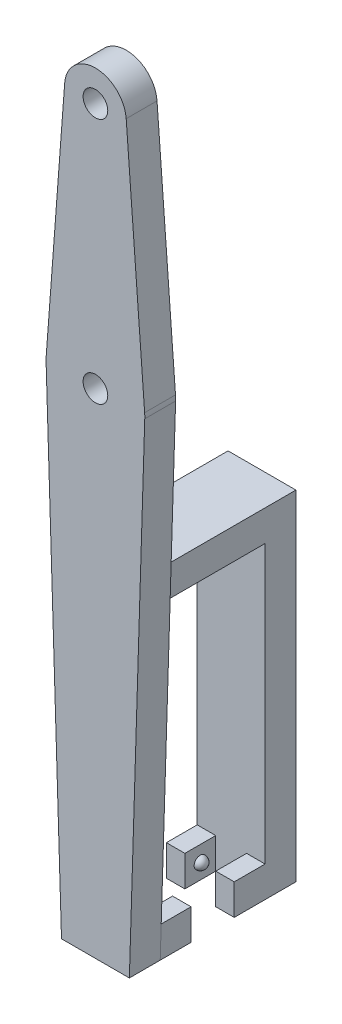
ISO-10303-21;
HEADER;
FILE_DESCRIPTION(('STEP AP214'),'2;1');
FILE_NAME('part.step','',(''),(''),'','','');
FILE_SCHEMA(('AUTOMOTIVE_DESIGN { 1 0 10303 214 1 1 1 1 }'));
ENDSEC;
DATA;
#1=APPLICATION_CONTEXT('core data for automotive mechanical design processes');
#2=APPLICATION_PROTOCOL_DEFINITION('international standard','automotive_design',2000,#1);
#3=PRODUCT_CONTEXT('',#1,'mechanical');
#4=PRODUCT('Part','Part','',(#3));
#5=PRODUCT_RELATED_PRODUCT_CATEGORY('part','',(#4));
#6=PRODUCT_DEFINITION_FORMATION('','',#4);
#7=PRODUCT_DEFINITION_CONTEXT('part definition',#1,'design');
#8=PRODUCT_DEFINITION('design','',#6,#7);
#9=PRODUCT_DEFINITION_SHAPE('','',#8);
#10=(LENGTH_UNIT() NAMED_UNIT(*) SI_UNIT(.MILLI.,.METRE.));
#11=(NAMED_UNIT(*) PLANE_ANGLE_UNIT() SI_UNIT($,.RADIAN.));
#12=(NAMED_UNIT(*) SI_UNIT($,.STERADIAN.) SOLID_ANGLE_UNIT());
#13=UNCERTAINTY_MEASURE_WITH_UNIT(LENGTH_MEASURE(1.E-05),#10,'distance_accuracy_value','');
#14=(GEOMETRIC_REPRESENTATION_CONTEXT(3) GLOBAL_UNCERTAINTY_ASSIGNED_CONTEXT((#13)) GLOBAL_UNIT_ASSIGNED_CONTEXT((#10,
#11,#12)) REPRESENTATION_CONTEXT('',''));
#15=CARTESIAN_POINT('',(0.,0.,0.));
#16=DIRECTION('',(0.,0.,1.));
#17=DIRECTION('',(1.,0.,0.));
#18=AXIS2_PLACEMENT_3D('',#15,#16,#17);
#19=CARTESIAN_POINT('',(0.,-62.4999999999999,5.));
#20=DIRECTION('',(0.,1.,0.));
#21=DIRECTION('',(0.,0.,1.));
#22=AXIS2_PLACEMENT_3D('',#19,#20,#21);
#23=PLANE('',#22);
#24=DIRECTION('',(0.,0.,1.));
#25=VECTOR('',#24,1.);
#26=CARTESIAN_POINT('',(2.50000000000002,-62.4999999999999,5.));
#27=LINE('',#26,#25);
#28=CARTESIAN_POINT('',(2.50000000000002,-62.4999999999999,-17.));
#29=VERTEX_POINT('',#28);
#30=CARTESIAN_POINT('',(2.50000000000002,-62.4999999999999,-12.));
#31=VERTEX_POINT('',#30);
#32=EDGE_CURVE('E891',#29,#31,#27,.T.);
#33=ORIENTED_EDGE('',*,*,#32,.F.);
#34=DIRECTION('',(1.,0.,0.));
#35=VECTOR('',#34,1.);
#36=CARTESIAN_POINT('',(0.,-62.4999999999999,-17.));
#37=LINE('',#36,#35);
#38=CARTESIAN_POINT('',(-2.49999999999998,-62.4999999999999,-17.));
#39=VERTEX_POINT('',#38);
#40=EDGE_CURVE('E219',#39,#29,#37,.T.);
#41=ORIENTED_EDGE('',*,*,#40,.F.);
#42=DIRECTION('',(0.,0.,-1.));
#43=VECTOR('',#42,1.);
#44=CARTESIAN_POINT('',(-2.49999999999999,-62.4999999999999,5.));
#45=LINE('',#44,#43);
#46=CARTESIAN_POINT('',(-2.49999999999998,-62.4999999999999,-12.));
#47=VERTEX_POINT('',#46);
#48=EDGE_CURVE('E889',#47,#39,#45,.T.);
#49=ORIENTED_EDGE('',*,*,#48,.F.);
#50=DIRECTION('',(-1.,0.,0.));
#51=VECTOR('',#50,1.);
#52=CARTESIAN_POINT('',(0.,-62.4999999999999,-12.));
#53=LINE('',#52,#51);
#54=CARTESIAN_POINT('',(-5.49999999999998,-62.4999999999999,-12.));
#55=VERTEX_POINT('',#54);
#56=EDGE_CURVE('E236',#47,#55,#53,.T.);
#57=ORIENTED_EDGE('',*,*,#56,.T.);
#58=DIRECTION('',(0.,0.,1.));
#59=VECTOR('',#58,1.);
#60=CARTESIAN_POINT('',(-5.5,-62.4999999999999,-22.));
#61=LINE('',#60,#59);
#62=CARTESIAN_POINT('',(-5.5,-62.4999999999999,-22.));
#63=VERTEX_POINT('',#62);
#64=EDGE_CURVE('E250',#63,#55,#61,.T.);
#65=ORIENTED_EDGE('',*,*,#64,.F.);
#66=DIRECTION('',(-1.,0.,0.));
#67=VECTOR('',#66,1.);
#68=CARTESIAN_POINT('',(5.5,-62.4999999999999,-22.));
#69=LINE('',#68,#67);
#70=CARTESIAN_POINT('',(5.5,-62.4999999999999,-22.));
#71=VERTEX_POINT('',#70);
#72=EDGE_CURVE('E254',#71,#63,#69,.T.);
#73=ORIENTED_EDGE('',*,*,#72,.F.);
#74=DIRECTION('',(0.,0.,-1.));
#75=VECTOR('',#74,1.);
#76=CARTESIAN_POINT('',(5.5,-62.4999999999999,-22.));
#77=LINE('',#76,#75);
#78=CARTESIAN_POINT('',(5.50000000000002,-62.4999999999999,-12.));
#79=VERTEX_POINT('',#78);
#80=EDGE_CURVE('E253',#79,#71,#77,.T.);
#81=ORIENTED_EDGE('',*,*,#80,.F.);
#82=EDGE_CURVE('E239',#79,#31,#53,.T.);
#83=ORIENTED_EDGE('',*,*,#82,.T.);
#84=EDGE_LOOP('',(#33,#41,#49,#57,#65,#73,#81,#83));
#85=FACE_BOUND('',#84,.T.);
#86=ADVANCED_FACE('F35',(#85),#23,.F.);
#87=CARTESIAN_POINT('',(0.,-57.5,-12.));
#88=DIRECTION('',(0.,-1.,0.));
#89=DIRECTION('',(0.,0.,-1.));
#90=AXIS2_PLACEMENT_3D('',#87,#88,#89);
#91=PLANE('',#90);
#92=DIRECTION('',(0.,0.,1.));
#93=VECTOR('',#92,1.);
#94=CARTESIAN_POINT('',(2.50000000000002,-57.5,-17.));
#95=LINE('',#94,#93);
#96=CARTESIAN_POINT('',(2.50000000000002,-57.5,-17.));
#97=VERTEX_POINT('',#96);
#98=CARTESIAN_POINT('',(2.50000000000002,-57.5,-12.));
#99=VERTEX_POINT('',#98);
#100=EDGE_CURVE('E225',#97,#99,#95,.T.);
#101=ORIENTED_EDGE('',*,*,#100,.T.);
#102=DIRECTION('',(-1.,0.,0.));
#103=VECTOR('',#102,1.);
#104=CARTESIAN_POINT('',(0.,-57.5,-12.));
#105=LINE('',#104,#103);
#106=CARTESIAN_POINT('',(5.50000000000002,-57.5,-12.));
#107=VERTEX_POINT('',#106);
#108=EDGE_CURVE('E902',#107,#99,#105,.T.);
#109=ORIENTED_EDGE('',*,*,#108,.F.);
#110=DIRECTION('',(0.,0.,-1.));
#111=VECTOR('',#110,1.);
#112=CARTESIAN_POINT('',(5.50000000000002,-57.5,-12.));
#113=LINE('',#112,#111);
#114=CARTESIAN_POINT('',(5.5,-57.5,-17.));
#115=VERTEX_POINT('',#114);
#116=EDGE_CURVE('E235',#107,#115,#113,.T.);
#117=ORIENTED_EDGE('',*,*,#116,.T.);
#118=DIRECTION('',(-1.,0.,0.));
#119=VECTOR('',#118,1.);
#120=CARTESIAN_POINT('',(0.,-57.5,-17.));
#121=LINE('',#120,#119);
#122=EDGE_CURVE('E60',#115,#97,#121,.T.);
#123=ORIENTED_EDGE('',*,*,#122,.T.);
#124=EDGE_LOOP('',(#101,#109,#117,#123));
#125=FACE_BOUND('',#124,.T.);
#126=ADVANCED_FACE('F233',(#125),#91,.F.);
#127=DIRECTION('',(0.,0.,-1.));
#128=VECTOR('',#127,1.);
#129=CARTESIAN_POINT('',(-2.49999999999998,-57.5,-17.));
#130=LINE('',#129,#128);
#131=CARTESIAN_POINT('',(-2.49999999999998,-57.5,-12.));
#132=VERTEX_POINT('',#131);
#133=CARTESIAN_POINT('',(-2.49999999999998,-57.5,-17.));
#134=VERTEX_POINT('',#133);
#135=EDGE_CURVE('E52',#132,#134,#130,.T.);
#136=ORIENTED_EDGE('',*,*,#135,.T.);
#137=CARTESIAN_POINT('',(-5.5,-57.5,-17.));
#138=VERTEX_POINT('',#137);
#139=EDGE_CURVE('E237',#134,#138,#121,.T.);
#140=ORIENTED_EDGE('',*,*,#139,.T.);
#141=DIRECTION('',(0.,0.,-1.));
#142=VECTOR('',#141,1.);
#143=CARTESIAN_POINT('',(-5.49999999999998,-57.5,-12.));
#144=LINE('',#143,#142);
#145=CARTESIAN_POINT('',(-5.49999999999998,-57.5,-12.));
#146=VERTEX_POINT('',#145);
#147=EDGE_CURVE('E245',#146,#138,#144,.T.);
#148=ORIENTED_EDGE('',*,*,#147,.F.);
#149=EDGE_CURVE('E901',#132,#146,#105,.T.);
#150=ORIENTED_EDGE('',*,*,#149,.F.);
#151=EDGE_LOOP('',(#136,#140,#148,#150));
#152=FACE_BOUND('',#151,.T.);
#153=ADVANCED_FACE('F447',(#152),#91,.F.);
#154=CARTESIAN_POINT('',(0.,0.,-12.));
#155=DIRECTION('',(0.,0.,1.));
#156=DIRECTION('',(-1.,0.,0.));
#157=AXIS2_PLACEMENT_3D('',#154,#155,#156);
#158=PLANE('',#157);
#159=ORIENTED_EDGE('',*,*,#108,.T.);
#160=DIRECTION('',(0.,-1.,0.));
#161=VECTOR('',#160,1.);
#162=CARTESIAN_POINT('',(2.50000000000002,0.,-12.));
#163=LINE('',#162,#161);
#164=EDGE_CURVE('E11',#99,#31,#163,.T.);
#165=ORIENTED_EDGE('',*,*,#164,.T.);
#166=ORIENTED_EDGE('',*,*,#82,.F.);
#167=DIRECTION('',(0.,1.,0.));
#168=VECTOR('',#167,1.);
#169=CARTESIAN_POINT('',(5.50000000000002,0.,-12.));
#170=LINE('',#169,#168);
#171=EDGE_CURVE('E900',#79,#107,#170,.T.);
#172=ORIENTED_EDGE('',*,*,#171,.T.);
#173=EDGE_LOOP('',(#159,#165,#166,#172));
#174=FACE_BOUND('',#173,.T.);
#175=ADVANCED_FACE('F620',(#174),#158,.T.);
#176=ORIENTED_EDGE('',*,*,#56,.F.);
#177=DIRECTION('',(0.,1.,0.));
#178=VECTOR('',#177,1.);
#179=CARTESIAN_POINT('',(-2.49999999999998,0.,-12.));
#180=LINE('',#179,#178);
#181=EDGE_CURVE('E44',#47,#132,#180,.T.);
#182=ORIENTED_EDGE('',*,*,#181,.T.);
#183=ORIENTED_EDGE('',*,*,#149,.T.);
#184=DIRECTION('',(0.,1.,0.));
#185=VECTOR('',#184,1.);
#186=CARTESIAN_POINT('',(-5.49999999999998,0.,-12.));
#187=LINE('',#186,#185);
#188=EDGE_CURVE('E243',#55,#146,#187,.T.);
#189=ORIENTED_EDGE('',*,*,#188,.F.);
#190=EDGE_LOOP('',(#176,#182,#183,#189));
#191=FACE_BOUND('',#190,.T.);
#192=ADVANCED_FACE('F454',(#191),#158,.T.);
#193=CARTESIAN_POINT('',(5.5,-74.5830459735945,-17.));
#194=DIRECTION('',(0.,0.,-1.));
#195=DIRECTION('',(-1.,0.,0.));
#196=AXIS2_PLACEMENT_3D('',#193,#194,#195);
#197=PLANE('',#196);
#198=ORIENTED_EDGE('',*,*,#122,.F.);
#199=DIRECTION('',(0.,1.,0.));
#200=VECTOR('',#199,1.);
#201=CARTESIAN_POINT('',(5.5,-74.5830459735945,-17.));
#202=LINE('',#201,#200);
#203=CARTESIAN_POINT('',(5.5,-12.4999999999999,-17.));
#204=VERTEX_POINT('',#203);
#205=EDGE_CURVE('E262',#115,#204,#202,.T.);
#206=ORIENTED_EDGE('',*,*,#205,.T.);
#207=DIRECTION('',(-1.,0.,0.));
#208=VECTOR('',#207,1.);
#209=CARTESIAN_POINT('',(5.5,-12.4999999999999,-17.));
#210=LINE('',#209,#208);
#211=CARTESIAN_POINT('',(-5.5,-12.4999999999999,-17.));
#212=VERTEX_POINT('',#211);
#213=EDGE_CURVE('E249',#204,#212,#210,.T.);
#214=ORIENTED_EDGE('',*,*,#213,.T.);
#215=DIRECTION('',(0.,1.,0.));
#216=VECTOR('',#215,1.);
#217=CARTESIAN_POINT('',(-5.5,-74.5830459735945,-17.));
#218=LINE('',#217,#216);
#219=EDGE_CURVE('E260',#138,#212,#218,.T.);
#220=ORIENTED_EDGE('',*,*,#219,.F.);
#221=ORIENTED_EDGE('',*,*,#139,.F.);
#222=DIRECTION('',(0.,1.,0.));
#223=VECTOR('',#222,1.);
#224=CARTESIAN_POINT('',(-2.49999999999998,-77.4999999999999,-17.));
#225=LINE('',#224,#223);
#226=EDGE_CURVE('E222',#39,#134,#225,.T.);
#227=ORIENTED_EDGE('',*,*,#226,.F.);
#228=ORIENTED_EDGE('',*,*,#40,.T.);
#229=DIRECTION('',(0.,1.,0.));
#230=VECTOR('',#229,1.);
#231=CARTESIAN_POINT('',(2.50000000000002,-77.4999999999999,-17.));
#232=LINE('',#231,#230);
#233=EDGE_CURVE('E214',#29,#97,#232,.T.);
#234=ORIENTED_EDGE('',*,*,#233,.T.);
#235=EDGE_LOOP('',(#198,#206,#214,#220,#221,#227,#228,#234));
#236=FACE_BOUND('',#235,.T.);
#237=ADVANCED_FACE('F216',(#236),#197,.F.);
#238=CARTESIAN_POINT('',(0.,-12.4999999999999,-22.));
#239=DIRECTION('',(0.,1.,0.));
#240=DIRECTION('',(0.,0.,1.));
#241=AXIS2_PLACEMENT_3D('',#238,#239,#240);
#242=PLANE('',#241);
#243=ORIENTED_EDGE('',*,*,#213,.F.);
#244=DIRECTION('',(0.,0.,1.));
#245=VECTOR('',#244,1.);
#246=CARTESIAN_POINT('',(5.5,-12.4999999999999,-22.));
#247=LINE('',#246,#245);
#248=CARTESIAN_POINT('',(5.5,-12.4999999999999,0.));
#249=VERTEX_POINT('',#248);
#250=EDGE_CURVE('E293',#204,#249,#247,.T.);
#251=ORIENTED_EDGE('',*,*,#250,.T.);
#252=DIRECTION('',(-1.,0.,0.));
#253=VECTOR('',#252,1.);
#254=CARTESIAN_POINT('',(0.,-12.4999999999999,0.));
#255=LINE('',#254,#253);
#256=CARTESIAN_POINT('',(-5.5,-12.4999999999999,0.));
#257=VERTEX_POINT('',#256);
#258=EDGE_CURVE('E283',#249,#257,#255,.T.);
#259=ORIENTED_EDGE('',*,*,#258,.T.);
#260=DIRECTION('',(0.,0.,1.));
#261=VECTOR('',#260,1.);
#262=CARTESIAN_POINT('',(-5.5,-12.4999999999999,-22.));
#263=LINE('',#262,#261);
#264=EDGE_CURVE('E310',#212,#257,#263,.T.);
#265=ORIENTED_EDGE('',*,*,#264,.F.);
#266=EDGE_LOOP('',(#243,#251,#259,#265));
#267=FACE_BOUND('',#266,.T.);
#268=ADVANCED_FACE('F453',(#267),#242,.F.);
#269=CARTESIAN_POINT('',(0.,-57.5,-5.));
#270=DIRECTION('',(0.,1.,0.));
#271=DIRECTION('',(0.,0.,1.));
#272=AXIS2_PLACEMENT_3D('',#269,#270,#271);
#273=PLANE('',#272);
#274=DIRECTION('',(0.,0.,-1.));
#275=VECTOR('',#274,1.);
#276=CARTESIAN_POINT('',(2.50000000000002,-57.5,0.));
#277=LINE('',#276,#275);
#278=CARTESIAN_POINT('',(2.50000000000002,-57.5,0.));
#279=VERTEX_POINT('',#278);
#280=CARTESIAN_POINT('',(2.50000000000002,-57.5,-5.));
#281=VERTEX_POINT('',#280);
#282=EDGE_CURVE('E257',#279,#281,#277,.T.);
#283=ORIENTED_EDGE('',*,*,#282,.F.);
#284=DIRECTION('',(-1.,0.,0.));
#285=VECTOR('',#284,1.);
#286=CARTESIAN_POINT('',(0.,-57.5,0.));
#287=LINE('',#286,#285);
#288=CARTESIAN_POINT('',(5.50000000000002,-57.5,0.));
#289=VERTEX_POINT('',#288);
#290=EDGE_CURVE('E331',#289,#279,#287,.T.);
#291=ORIENTED_EDGE('',*,*,#290,.F.);
#292=DIRECTION('',(0.,0.,1.));
#293=VECTOR('',#292,1.);
#294=CARTESIAN_POINT('',(5.50000000000002,-57.5,-5.));
#295=LINE('',#294,#293);
#296=CARTESIAN_POINT('',(5.50000000000002,-57.5,-5.));
#297=VERTEX_POINT('',#296);
#298=EDGE_CURVE('E338',#297,#289,#295,.T.);
#299=ORIENTED_EDGE('',*,*,#298,.F.);
#300=DIRECTION('',(-1.,0.,0.));
#301=VECTOR('',#300,1.);
#302=CARTESIAN_POINT('',(0.,-57.5,-5.));
#303=LINE('',#302,#301);
#304=EDGE_CURVE('E321',#297,#281,#303,.T.);
#305=ORIENTED_EDGE('',*,*,#304,.T.);
#306=EDGE_LOOP('',(#283,#291,#299,#305));
#307=FACE_BOUND('',#306,.T.);
#308=ADVANCED_FACE('F490',(#307),#273,.T.);
#309=CARTESIAN_POINT('',(0.,0.,-5.));
#310=DIRECTION('',(0.,0.,-1.));
#311=DIRECTION('',(-1.,0.,0.));
#312=AXIS2_PLACEMENT_3D('',#309,#310,#311);
#313=PLANE('',#312);
#314=DIRECTION('',(0.,-1.,0.));
#315=VECTOR('',#314,1.);
#316=CARTESIAN_POINT('',(2.50000000000002,0.,-5.));
#317=LINE('',#316,#315);
#318=CARTESIAN_POINT('',(2.50000000000002,-62.4999999999999,-5.));
#319=VERTEX_POINT('',#318);
#320=EDGE_CURVE('E416',#281,#319,#317,.T.);
#321=ORIENTED_EDGE('',*,*,#320,.F.);
#322=ORIENTED_EDGE('',*,*,#304,.F.);
#323=DIRECTION('',(0.,1.,0.));
#324=VECTOR('',#323,1.);
#325=CARTESIAN_POINT('',(5.50000000000002,0.,-5.));
#326=LINE('',#325,#324);
#327=CARTESIAN_POINT('',(5.50000000000002,-62.4999999999999,-5.));
#328=VERTEX_POINT('',#327);
#329=EDGE_CURVE('E324',#328,#297,#326,.T.);
#330=ORIENTED_EDGE('',*,*,#329,.F.);
#331=DIRECTION('',(-1.,0.,0.));
#332=VECTOR('',#331,1.);
#333=CARTESIAN_POINT('',(0.,-62.4999999999999,-5.));
#334=LINE('',#333,#332);
#335=EDGE_CURVE('E313',#328,#319,#334,.T.);
#336=ORIENTED_EDGE('',*,*,#335,.T.);
#337=EDGE_LOOP('',(#321,#322,#330,#336));
#338=FACE_BOUND('',#337,.T.);
#339=ADVANCED_FACE('F496',(#338),#313,.T.);
#340=CARTESIAN_POINT('',(0.,0.,0.));
#341=DIRECTION('',(0.,0.,1.));
#342=DIRECTION('',(1.,0.,0.));
#343=AXIS2_PLACEMENT_3D('',#340,#341,#342);
#344=PLANE('',#343);
#345=CARTESIAN_POINT('',(0.,57.5,0.));
#346=DIRECTION('',(0.,0.,1.));
#347=DIRECTION('',(1.,0.,0.));
#348=AXIS2_PLACEMENT_3D('',#345,#346,#347);
#349=CIRCLE('',#348,2.);
#350=CARTESIAN_POINT('',(2.,57.5,0.));
#351=VERTEX_POINT('',#350);
#352=EDGE_CURVE('E352',#351,#351,#349,.T.);
#353=ORIENTED_EDGE('',*,*,#352,.T.);
#354=EDGE_LOOP('',(#353));
#355=FACE_BOUND('',#354,.T.);
#356=CARTESIAN_POINT('',(0.,17.5000000000001,0.));
#357=DIRECTION('',(0.,0.,1.));
#358=DIRECTION('',(1.,0.,0.));
#359=AXIS2_PLACEMENT_3D('',#356,#357,#358);
#360=CIRCLE('',#359,2.);
#361=CARTESIAN_POINT('',(2.,17.5000000000001,0.));
#362=VERTEX_POINT('',#361);
#363=EDGE_CURVE('E389',#362,#362,#360,.T.);
#364=ORIENTED_EDGE('',*,*,#363,.T.);
#365=EDGE_LOOP('',(#364));
#366=FACE_BOUND('',#365,.T.);
#367=DIRECTION('',(0.0312836499046037,0.999510546842126,0.));
#368=VECTOR('',#367,1.);
#369=CARTESIAN_POINT('',(7.44888845932807,-0.233142531088138,0.));
#370=LINE('',#369,#368);
#371=CARTESIAN_POINT('',(5.50000000000002,-62.4999999999999,0.));
#372=VERTEX_POINT('',#371);
#373=CARTESIAN_POINT('',(7.99608437473701,17.2497308007632,0.));
#374=VERTEX_POINT('',#373);
#375=EDGE_CURVE('E347',#372,#374,#370,.T.);
#376=ORIENTED_EDGE('',*,*,#375,.F.);
#377=DIRECTION('',(0.,1.,0.));
#378=VECTOR('',#377,1.);
#379=CARTESIAN_POINT('',(5.50000000000002,0.,0.));
#380=LINE('',#379,#378);
#381=EDGE_CURVE('E334',#372,#289,#380,.T.);
#382=ORIENTED_EDGE('',*,*,#381,.T.);
#383=ORIENTED_EDGE('',*,*,#290,.T.);
#384=DIRECTION('',(0.,1.,0.));
#385=VECTOR('',#384,1.);
#386=CARTESIAN_POINT('',(2.50000000000002,-77.4999999999999,0.));
#387=LINE('',#386,#385);
#388=CARTESIAN_POINT('',(2.50000000000002,-62.4999999999999,0.));
#389=VERTEX_POINT('',#388);
#390=EDGE_CURVE('E271',#389,#279,#387,.T.);
#391=ORIENTED_EDGE('',*,*,#390,.F.);
#392=DIRECTION('',(1.,0.,0.));
#393=VECTOR('',#392,1.);
#394=CARTESIAN_POINT('',(0.,-62.4999999999999,0.));
#395=LINE('',#394,#393);
#396=CARTESIAN_POINT('',(-2.49999999999998,-62.4999999999999,0.));
#397=VERTEX_POINT('',#396);
#398=EDGE_CURVE('E280',#397,#389,#395,.T.);
#399=ORIENTED_EDGE('',*,*,#398,.F.);
#400=DIRECTION('',(0.,1.,0.));
#401=VECTOR('',#400,1.);
#402=CARTESIAN_POINT('',(-2.49999999999998,-77.4999999999999,0.));
#403=LINE('',#402,#401);
#404=CARTESIAN_POINT('',(-2.49999999999998,-57.5,0.));
#405=VERTEX_POINT('',#404);
#406=EDGE_CURVE('E270',#397,#405,#403,.T.);
#407=ORIENTED_EDGE('',*,*,#406,.T.);
#408=CARTESIAN_POINT('',(-5.49999999999998,-57.5,0.));
#409=VERTEX_POINT('',#408);
#410=EDGE_CURVE('E330',#405,#409,#287,.T.);
#411=ORIENTED_EDGE('',*,*,#410,.T.);
#412=DIRECTION('',(0.,1.,0.));
#413=VECTOR('',#412,1.);
#414=CARTESIAN_POINT('',(-5.49999999999998,0.,0.));
#415=LINE('',#414,#413);
#416=CARTESIAN_POINT('',(-5.49999999999998,-62.4999999999999,0.));
#417=VERTEX_POINT('',#416);
#418=EDGE_CURVE('E312',#417,#409,#415,.T.);
#419=ORIENTED_EDGE('',*,*,#418,.F.);
#420=DIRECTION('',(0.031283649904604,-0.999510546842126,0.));
#421=VECTOR('',#420,1.);
#422=CARTESIAN_POINT('',(-7.44888845932806,-0.23314253108814,0.));
#423=LINE('',#422,#421);
#424=CARTESIAN_POINT('',(-7.99608437473701,17.2497308007632,0.));
#425=VERTEX_POINT('',#424);
#426=EDGE_CURVE('E386',#425,#417,#423,.T.);
#427=ORIENTED_EDGE('',*,*,#426,.F.);
#428=CARTESIAN_POINT('',(0.,17.5000000000001,0.));
#429=DIRECTION('',(0.,0.,1.));
#430=DIRECTION('',(1.,0.,0.));
#431=AXIS2_PLACEMENT_3D('',#428,#429,#430);
#432=CIRCLE('',#431,8.);
#433=CARTESIAN_POINT('',(-7.97746827007165,18.1000000000001,0.));
#434=VERTEX_POINT('',#433);
#435=EDGE_CURVE('E379',#434,#425,#432,.T.);
#436=ORIENTED_EDGE('',*,*,#435,.F.);
#437=DIRECTION('',(-0.0749999999999998,-0.997183533758957,0.));
#438=VECTOR('',#437,1.);
#439=CARTESIAN_POINT('',(-9.28627165813028,0.698437499999998,0.));
#440=LINE('',#439,#438);
#441=CARTESIAN_POINT('',(-4.98591766879479,57.875,0.));
#442=VERTEX_POINT('',#441);
#443=EDGE_CURVE('E384',#442,#434,#440,.T.);
#444=ORIENTED_EDGE('',*,*,#443,.F.);
#445=CARTESIAN_POINT('',(0.,57.5,0.));
#446=DIRECTION('',(0.,0.,1.));
#447=DIRECTION('',(1.,0.,0.));
#448=AXIS2_PLACEMENT_3D('',#445,#446,#447);
#449=CIRCLE('',#448,5.);
#450=CARTESIAN_POINT('',(4.98591766879478,57.875,0.));
#451=VERTEX_POINT('',#450);
#452=EDGE_CURVE('E382',#451,#442,#449,.T.);
#453=ORIENTED_EDGE('',*,*,#452,.F.);
#454=DIRECTION('',(0.0750000000000001,-0.997183533758957,0.));
#455=VECTOR('',#454,1.);
#456=CARTESIAN_POINT('',(9.28627165813029,0.698437500000001,0.));
#457=LINE('',#456,#455);
#458=CARTESIAN_POINT('',(7.97746827007165,18.1000000000001,0.));
#459=VERTEX_POINT('',#458);
#460=EDGE_CURVE('E378',#451,#459,#457,.T.);
#461=ORIENTED_EDGE('',*,*,#460,.T.);
#462=EDGE_CURVE('E375',#374,#459,#432,.T.);
#463=ORIENTED_EDGE('',*,*,#462,.F.);
#464=EDGE_LOOP('',(#376,#382,#383,#391,#399,#407,#411,#419,#427,#436,#444,#453,#461,#463));
#465=FACE_BOUND('',#464,.T.);
#466=ORIENTED_EDGE('',*,*,#258,.F.);
#467=DIRECTION('',(0.,1.,0.));
#468=VECTOR('',#467,1.);
#469=CARTESIAN_POINT('',(5.5,0.,0.));
#470=LINE('',#469,#468);
#471=CARTESIAN_POINT('',(5.5,-7.49999999999994,0.));
#472=VERTEX_POINT('',#471);
#473=EDGE_CURVE('E287',#249,#472,#470,.T.);
#474=ORIENTED_EDGE('',*,*,#473,.T.);
#475=DIRECTION('',(-1.,0.,0.));
#476=VECTOR('',#475,1.);
#477=CARTESIAN_POINT('',(0.,-7.49999999999994,0.));
#478=LINE('',#477,#476);
#479=CARTESIAN_POINT('',(-5.5,-7.49999999999994,0.));
#480=VERTEX_POINT('',#479);
#481=EDGE_CURVE('E299',#472,#480,#478,.T.);
#482=ORIENTED_EDGE('',*,*,#481,.T.);
#483=DIRECTION('',(0.,1.,0.));
#484=VECTOR('',#483,1.);
#485=CARTESIAN_POINT('',(-5.5,0.,0.));
#486=LINE('',#485,#484);
#487=EDGE_CURVE('E296',#257,#480,#486,.T.);
#488=ORIENTED_EDGE('',*,*,#487,.F.);
#489=EDGE_LOOP('',(#466,#474,#482,#488));
#490=FACE_BOUND('',#489,.T.);
#491=ADVANCED_FACE('F513',(#355,#366,#465,#490),#344,.F.);
#492=CARTESIAN_POINT('',(7.44888845932807,-0.233142531088138,5.));
#493=DIRECTION('',(-0.999510546842126,0.0312836499046037,0.));
#494=DIRECTION('',(-0.0312836499046037,-0.999510546842126,0.));
#495=AXIS2_PLACEMENT_3D('',#492,#493,#494);
#496=PLANE('',#495);
#497=ORIENTED_EDGE('',*,*,#375,.T.);
#498=DIRECTION('',(0.,0.,-1.));
#499=VECTOR('',#498,1.);
#500=CARTESIAN_POINT('',(7.99608437473701,17.2497308007632,5.));
#501=LINE('',#500,#499);
#502=CARTESIAN_POINT('',(7.99608437473701,17.2497308007632,5.));
#503=VERTEX_POINT('',#502);
#504=EDGE_CURVE('E411',#503,#374,#501,.T.);
#505=ORIENTED_EDGE('',*,*,#504,.F.);
#506=DIRECTION('',(0.0312836499046037,0.999510546842126,0.));
#507=VECTOR('',#506,1.);
#508=CARTESIAN_POINT('',(7.44888845932807,-0.233142531088138,5.));
#509=LINE('',#508,#507);
#510=CARTESIAN_POINT('',(5.50000000000002,-62.4999999999999,5.));
#511=VERTEX_POINT('',#510);
#512=EDGE_CURVE('E348',#511,#503,#509,.T.);
#513=ORIENTED_EDGE('',*,*,#512,.F.);
#514=DIRECTION('',(0.,0.,-1.));
#515=VECTOR('',#514,1.);
#516=CARTESIAN_POINT('',(5.50000000000002,-62.4999999999999,5.));
#517=LINE('',#516,#515);
#518=EDGE_CURVE('E372',#511,#372,#517,.T.);
#519=ORIENTED_EDGE('',*,*,#518,.T.);
#520=EDGE_LOOP('',(#497,#505,#513,#519));
#521=FACE_BOUND('',#520,.T.);
#522=ADVANCED_FACE('F37',(#521),#496,.F.);
#523=CARTESIAN_POINT('',(0.,17.5000000000001,5.));
#524=DIRECTION('',(0.,0.,-1.));
#525=DIRECTION('',(-1.,0.,0.));
#526=AXIS2_PLACEMENT_3D('',#523,#524,#525);
#527=CYLINDRICAL_SURFACE('',#526,8.);
#528=ORIENTED_EDGE('',*,*,#462,.T.);
#529=DIRECTION('',(0.,0.,-1.));
#530=VECTOR('',#529,1.);
#531=CARTESIAN_POINT('',(7.97746827007165,18.1000000000001,5.));
#532=LINE('',#531,#530);
#533=CARTESIAN_POINT('',(7.97746827007165,18.1000000000001,5.));
#534=VERTEX_POINT('',#533);
#535=EDGE_CURVE('E409',#534,#459,#532,.T.);
#536=ORIENTED_EDGE('',*,*,#535,.F.);
#537=CARTESIAN_POINT('',(0.,17.5000000000001,5.));
#538=DIRECTION('',(0.,0.,1.));
#539=DIRECTION('',(1.,0.,0.));
#540=AXIS2_PLACEMENT_3D('',#537,#538,#539);
#541=CIRCLE('',#540,8.);
#542=EDGE_CURVE('E351',#503,#534,#541,.T.);
#543=ORIENTED_EDGE('',*,*,#542,.F.);
#544=ORIENTED_EDGE('',*,*,#504,.T.);
#545=EDGE_LOOP('',(#528,#536,#543,#544));
#546=FACE_BOUND('',#545,.T.);
#547=ADVANCED_FACE('F537',(#546),#527,.T.);
#548=CARTESIAN_POINT('',(9.28627165813029,0.698437500000001,5.));
#549=DIRECTION('',(0.997183533758957,0.0750000000000001,0.));
#550=DIRECTION('',(-0.0750000000000001,0.997183533758957,0.));
#551=AXIS2_PLACEMENT_3D('',#548,#549,#550);
#552=PLANE('',#551);
#553=ORIENTED_EDGE('',*,*,#460,.F.);
#554=DIRECTION('',(0.,0.,-1.));
#555=VECTOR('',#554,1.);
#556=CARTESIAN_POINT('',(4.98591766879478,57.875,5.));
#557=LINE('',#556,#555);
#558=CARTESIAN_POINT('',(4.98591766879478,57.875,5.));
#559=VERTEX_POINT('',#558);
#560=EDGE_CURVE('E407',#559,#451,#557,.T.);
#561=ORIENTED_EDGE('',*,*,#560,.F.);
#562=DIRECTION('',(0.0750000000000001,-0.997183533758957,0.));
#563=VECTOR('',#562,1.);
#564=CARTESIAN_POINT('',(9.28627165813029,0.698437500000001,5.));
#565=LINE('',#564,#563);
#566=EDGE_CURVE('E354',#559,#534,#565,.T.);
#567=ORIENTED_EDGE('',*,*,#566,.T.);
#568=ORIENTED_EDGE('',*,*,#535,.T.);
#569=EDGE_LOOP('',(#553,#561,#567,#568));
#570=FACE_BOUND('',#569,.T.);
#571=ADVANCED_FACE('F543',(#570),#552,.T.);
#572=CARTESIAN_POINT('',(0.,57.5,5.));
#573=DIRECTION('',(0.,0.,-1.));
#574=DIRECTION('',(-1.,0.,0.));
#575=AXIS2_PLACEMENT_3D('',#572,#573,#574);
#576=CYLINDRICAL_SURFACE('',#575,5.);
#577=ORIENTED_EDGE('',*,*,#452,.T.);
#578=DIRECTION('',(0.,0.,-1.));
#579=VECTOR('',#578,1.);
#580=CARTESIAN_POINT('',(-4.98591766879479,57.875,5.));
#581=LINE('',#580,#579);
#582=CARTESIAN_POINT('',(-4.98591766879479,57.875,5.));
#583=VERTEX_POINT('',#582);
#584=EDGE_CURVE('E404',#583,#442,#581,.T.);
#585=ORIENTED_EDGE('',*,*,#584,.F.);
#586=CARTESIAN_POINT('',(0.,57.5,5.));
#587=DIRECTION('',(0.,0.,1.));
#588=DIRECTION('',(1.,0.,0.));
#589=AXIS2_PLACEMENT_3D('',#586,#587,#588);
#590=CIRCLE('',#589,5.);
#591=EDGE_CURVE('E358',#559,#583,#590,.T.);
#592=ORIENTED_EDGE('',*,*,#591,.F.);
#593=ORIENTED_EDGE('',*,*,#560,.T.);
#594=EDGE_LOOP('',(#577,#585,#592,#593));
#595=FACE_BOUND('',#594,.T.);
#596=ADVANCED_FACE('F540',(#595),#576,.T.);
#597=CARTESIAN_POINT('',(-9.28627165813028,0.698437499999998,5.));
#598=DIRECTION('',(0.997183533758957,-0.0749999999999998,0.));
#599=DIRECTION('',(0.0749999999999998,0.997183533758957,0.));
#600=AXIS2_PLACEMENT_3D('',#597,#598,#599);
#601=PLANE('',#600);
#602=ORIENTED_EDGE('',*,*,#443,.T.);
#603=DIRECTION('',(0.,0.,-1.));
#604=VECTOR('',#603,1.);
#605=CARTESIAN_POINT('',(-7.97746827007165,18.1000000000001,5.));
#606=LINE('',#605,#604);
#607=CARTESIAN_POINT('',(-7.97746827007165,18.1000000000001,5.));
#608=VERTEX_POINT('',#607);
#609=EDGE_CURVE('E401',#608,#434,#606,.T.);
#610=ORIENTED_EDGE('',*,*,#609,.F.);
#611=DIRECTION('',(-0.0749999999999998,-0.997183533758957,0.));
#612=VECTOR('',#611,1.);
#613=CARTESIAN_POINT('',(-9.28627165813028,0.698437499999998,5.));
#614=LINE('',#613,#612);
#615=EDGE_CURVE('E360',#583,#608,#614,.T.);
#616=ORIENTED_EDGE('',*,*,#615,.F.);
#617=ORIENTED_EDGE('',*,*,#584,.T.);
#618=EDGE_LOOP('',(#602,#610,#616,#617));
#619=FACE_BOUND('',#618,.T.);
#620=ADVANCED_FACE('F535',(#619),#601,.F.);
#621=ORIENTED_EDGE('',*,*,#435,.T.);
#622=DIRECTION('',(0.,0.,-1.));
#623=VECTOR('',#622,1.);
#624=CARTESIAN_POINT('',(-7.99608437473701,17.2497308007632,5.));
#625=LINE('',#624,#623);
#626=CARTESIAN_POINT('',(-7.99608437473701,17.2497308007632,5.));
#627=VERTEX_POINT('',#626);
#628=EDGE_CURVE('E398',#627,#425,#625,.T.);
#629=ORIENTED_EDGE('',*,*,#628,.F.);
#630=EDGE_CURVE('E355',#608,#627,#541,.T.);
#631=ORIENTED_EDGE('',*,*,#630,.F.);
#632=ORIENTED_EDGE('',*,*,#609,.T.);
#633=EDGE_LOOP('',(#621,#629,#631,#632));
#634=FACE_BOUND('',#633,.T.);
#635=ADVANCED_FACE('F531',(#634),#527,.T.);
#636=CARTESIAN_POINT('',(-7.44888845932806,-0.23314253108814,5.));
#637=DIRECTION('',(0.999510546842126,0.031283649904604,0.));
#638=DIRECTION('',(-0.031283649904604,0.999510546842126,0.));
#639=AXIS2_PLACEMENT_3D('',#636,#637,#638);
#640=PLANE('',#639);
#641=ORIENTED_EDGE('',*,*,#426,.T.);
#642=DIRECTION('',(0.,0.,-1.));
#643=VECTOR('',#642,1.);
#644=CARTESIAN_POINT('',(-5.49999999999998,-62.4999999999999,5.));
#645=LINE('',#644,#643);
#646=CARTESIAN_POINT('',(-5.49999999999998,-62.4999999999999,5.));
#647=VERTEX_POINT('',#646);
#648=EDGE_CURVE('E395',#647,#417,#645,.T.);
#649=ORIENTED_EDGE('',*,*,#648,.F.);
#650=DIRECTION('',(0.031283649904604,-0.999510546842126,0.));
#651=VECTOR('',#650,1.);
#652=CARTESIAN_POINT('',(-7.44888845932806,-0.23314253108814,5.));
#653=LINE('',#652,#651);
#654=EDGE_CURVE('E362',#627,#647,#653,.T.);
#655=ORIENTED_EDGE('',*,*,#654,.F.);
#656=ORIENTED_EDGE('',*,*,#628,.T.);
#657=EDGE_LOOP('',(#641,#649,#655,#656));
#658=FACE_BOUND('',#657,.T.);
#659=ADVANCED_FACE('F524',(#658),#640,.F.);
#660=CARTESIAN_POINT('',(0.,17.5000000000001,5.));
#661=DIRECTION('',(0.,0.,-1.));
#662=DIRECTION('',(-1.,0.,0.));
#663=AXIS2_PLACEMENT_3D('',#660,#661,#662);
#664=CYLINDRICAL_SURFACE('',#663,2.);
#665=CARTESIAN_POINT('',(0.,17.5000000000001,5.));
#666=DIRECTION('',(0.,0.,1.));
#667=DIRECTION('',(1.,0.,0.));
#668=AXIS2_PLACEMENT_3D('',#665,#666,#667);
#669=CIRCLE('',#668,2.);
#670=CARTESIAN_POINT('',(2.,17.5000000000001,5.));
#671=VERTEX_POINT('',#670);
#672=EDGE_CURVE('E366',#671,#671,#669,.T.);
#673=ORIENTED_EDGE('',*,*,#672,.T.);
#674=EDGE_LOOP('',(#673));
#675=FACE_BOUND('',#674,.T.);
#676=ORIENTED_EDGE('',*,*,#363,.F.);
#677=EDGE_LOOP('',(#676));
#678=FACE_BOUND('',#677,.T.);
#679=ADVANCED_FACE('F521',(#675,#678),#664,.F.);
#680=CARTESIAN_POINT('',(0.,-62.4999999999999,5.));
#681=DIRECTION('',(0.,1.,0.));
#682=DIRECTION('',(0.,0.,1.));
#683=AXIS2_PLACEMENT_3D('',#680,#681,#682);
#684=PLANE('',#683);
#685=ORIENTED_EDGE('',*,*,#398,.T.);
#686=DIRECTION('',(0.,0.,-1.));
#687=VECTOR('',#686,1.);
#688=CARTESIAN_POINT('',(2.50000000000002,-62.4999999999999,5.));
#689=LINE('',#688,#687);
#690=EDGE_CURVE('E277',#389,#319,#689,.T.);
#691=ORIENTED_EDGE('',*,*,#690,.T.);
#692=ORIENTED_EDGE('',*,*,#335,.F.);
#693=DIRECTION('',(0.,0.,1.));
#694=VECTOR('',#693,1.);
#695=CARTESIAN_POINT('',(5.50000000000002,-62.4999999999999,-5.));
#696=LINE('',#695,#694);
#697=EDGE_CURVE('E327',#328,#372,#696,.T.);
#698=ORIENTED_EDGE('',*,*,#697,.T.);
#699=ORIENTED_EDGE('',*,*,#518,.F.);
#700=DIRECTION('',(1.,0.,0.));
#701=VECTOR('',#700,1.);
#702=CARTESIAN_POINT('',(0.,-62.4999999999999,5.));
#703=LINE('',#702,#701);
#704=EDGE_CURVE('E364',#647,#511,#703,.T.);
#705=ORIENTED_EDGE('',*,*,#704,.F.);
#706=ORIENTED_EDGE('',*,*,#648,.T.);
#707=DIRECTION('',(0.,0.,1.));
#708=VECTOR('',#707,1.);
#709=CARTESIAN_POINT('',(-5.49999999999998,-62.4999999999999,-5.));
#710=LINE('',#709,#708);
#711=CARTESIAN_POINT('',(-5.49999999999998,-62.4999999999999,-5.));
#712=VERTEX_POINT('',#711);
#713=EDGE_CURVE('E344',#712,#417,#710,.T.);
#714=ORIENTED_EDGE('',*,*,#713,.F.);
#715=CARTESIAN_POINT('',(-2.49999999999998,-62.4999999999999,-5.));
#716=VERTEX_POINT('',#715);
#717=EDGE_CURVE('E317',#716,#712,#334,.T.);
#718=ORIENTED_EDGE('',*,*,#717,.F.);
#719=DIRECTION('',(0.,0.,1.));
#720=VECTOR('',#719,1.);
#721=CARTESIAN_POINT('',(-2.49999999999998,-62.4999999999999,5.));
#722=LINE('',#721,#720);
#723=EDGE_CURVE('E273',#716,#397,#722,.T.);
#724=ORIENTED_EDGE('',*,*,#723,.T.);
#725=EDGE_LOOP('',(#685,#691,#692,#698,#699,#705,#706,#714,#718,#724));
#726=FACE_BOUND('',#725,.T.);
#727=ADVANCED_FACE('F519',(#726),#684,.F.);
#728=CARTESIAN_POINT('',(0.,57.5,5.));
#729=DIRECTION('',(0.,0.,-1.));
#730=DIRECTION('',(-1.,0.,0.));
#731=AXIS2_PLACEMENT_3D('',#728,#729,#730);
#732=CYLINDRICAL_SURFACE('',#731,2.);
#733=CARTESIAN_POINT('',(0.,57.5,5.));
#734=DIRECTION('',(0.,0.,1.));
#735=DIRECTION('',(1.,0.,0.));
#736=AXIS2_PLACEMENT_3D('',#733,#734,#735);
#737=CIRCLE('',#736,2.);
#738=CARTESIAN_POINT('',(2.,57.5,5.));
#739=VERTEX_POINT('',#738);
#740=EDGE_CURVE('E369',#739,#739,#737,.T.);
#741=ORIENTED_EDGE('',*,*,#740,.T.);
#742=EDGE_LOOP('',(#741));
#743=FACE_BOUND('',#742,.T.);
#744=ORIENTED_EDGE('',*,*,#352,.F.);
#745=EDGE_LOOP('',(#744));
#746=FACE_BOUND('',#745,.T.);
#747=ADVANCED_FACE('F511',(#743,#746),#732,.F.);
#748=CARTESIAN_POINT('',(0.,0.,5.));
#749=DIRECTION('',(0.,0.,1.));
#750=DIRECTION('',(1.,0.,0.));
#751=AXIS2_PLACEMENT_3D('',#748,#749,#750);
#752=PLANE('',#751);
#753=ORIENTED_EDGE('',*,*,#512,.T.);
#754=ORIENTED_EDGE('',*,*,#542,.T.);
#755=ORIENTED_EDGE('',*,*,#566,.F.);
#756=ORIENTED_EDGE('',*,*,#591,.T.);
#757=ORIENTED_EDGE('',*,*,#615,.T.);
#758=ORIENTED_EDGE('',*,*,#630,.T.);
#759=ORIENTED_EDGE('',*,*,#654,.T.);
#760=ORIENTED_EDGE('',*,*,#704,.T.);
#761=EDGE_LOOP('',(#753,#754,#755,#756,#757,#758,#759,#760));
#762=FACE_BOUND('',#761,.T.);
#763=ORIENTED_EDGE('',*,*,#672,.F.);
#764=EDGE_LOOP('',(#763));
#765=FACE_BOUND('',#764,.T.);
#766=ORIENTED_EDGE('',*,*,#740,.F.);
#767=EDGE_LOOP('',(#766));
#768=FACE_BOUND('',#767,.T.);
#769=ADVANCED_FACE('F507',(#762,#765,#768),#752,.T.);
#770=CARTESIAN_POINT('',(-5.49999999999998,0.,-5.));
#771=DIRECTION('',(1.,0.,0.));
#772=DIRECTION('',(0.,0.,-1.));
#773=AXIS2_PLACEMENT_3D('',#770,#771,#772);
#774=PLANE('',#773);
#775=ORIENTED_EDGE('',*,*,#418,.T.);
#776=DIRECTION('',(0.,0.,1.));
#777=VECTOR('',#776,1.);
#778=CARTESIAN_POINT('',(-5.49999999999998,-57.5,-5.));
#779=LINE('',#778,#777);
#780=CARTESIAN_POINT('',(-5.49999999999998,-57.5,-5.));
#781=VERTEX_POINT('',#780);
#782=EDGE_CURVE('E341',#781,#409,#779,.T.);
#783=ORIENTED_EDGE('',*,*,#782,.F.);
#784=DIRECTION('',(0.,1.,0.));
#785=VECTOR('',#784,1.);
#786=CARTESIAN_POINT('',(-5.49999999999998,0.,-5.));
#787=LINE('',#786,#785);
#788=EDGE_CURVE('E316',#712,#781,#787,.T.);
#789=ORIENTED_EDGE('',*,*,#788,.F.);
#790=ORIENTED_EDGE('',*,*,#713,.T.);
#791=EDGE_LOOP('',(#775,#783,#789,#790));
#792=FACE_BOUND('',#791,.T.);
#793=ADVANCED_FACE('F503',(#792),#774,.F.);
#794=DIRECTION('',(0.,0.,1.));
#795=VECTOR('',#794,1.);
#796=CARTESIAN_POINT('',(-2.49999999999998,-57.5,0.));
#797=LINE('',#796,#795);
#798=CARTESIAN_POINT('',(-2.49999999999998,-57.5,-5.));
#799=VERTEX_POINT('',#798);
#800=EDGE_CURVE('E267',#799,#405,#797,.T.);
#801=ORIENTED_EDGE('',*,*,#800,.F.);
#802=EDGE_CURVE('E320',#799,#781,#303,.T.);
#803=ORIENTED_EDGE('',*,*,#802,.T.);
#804=ORIENTED_EDGE('',*,*,#782,.T.);
#805=ORIENTED_EDGE('',*,*,#410,.F.);
#806=EDGE_LOOP('',(#801,#803,#804,#805));
#807=FACE_BOUND('',#806,.T.);
#808=ADVANCED_FACE('F499',(#807),#273,.T.);
#809=CARTESIAN_POINT('',(5.50000000000002,0.,-5.));
#810=DIRECTION('',(1.,0.,0.));
#811=DIRECTION('',(0.,0.,-1.));
#812=AXIS2_PLACEMENT_3D('',#809,#810,#811);
#813=PLANE('',#812);
#814=ORIENTED_EDGE('',*,*,#381,.F.);
#815=ORIENTED_EDGE('',*,*,#697,.F.);
#816=ORIENTED_EDGE('',*,*,#329,.T.);
#817=ORIENTED_EDGE('',*,*,#298,.T.);
#818=EDGE_LOOP('',(#814,#815,#816,#817));
#819=FACE_BOUND('',#818,.T.);
#820=ADVANCED_FACE('F494',(#819),#813,.T.);
#821=DIRECTION('',(0.,1.,0.));
#822=VECTOR('',#821,1.);
#823=CARTESIAN_POINT('',(-2.49999999999998,0.,-5.));
#824=LINE('',#823,#822);
#825=EDGE_CURVE('E414',#716,#799,#824,.T.);
#826=ORIENTED_EDGE('',*,*,#825,.F.);
#827=ORIENTED_EDGE('',*,*,#717,.T.);
#828=ORIENTED_EDGE('',*,*,#788,.T.);
#829=ORIENTED_EDGE('',*,*,#802,.F.);
#830=EDGE_LOOP('',(#826,#827,#828,#829));
#831=FACE_BOUND('',#830,.T.);
#832=ADVANCED_FACE('F486',(#831),#313,.T.);
#833=CARTESIAN_POINT('',(-5.5,0.,-22.));
#834=DIRECTION('',(1.,0.,0.));
#835=DIRECTION('',(0.,0.,-1.));
#836=AXIS2_PLACEMENT_3D('',#833,#834,#835);
#837=PLANE('',#836);
#838=ORIENTED_EDGE('',*,*,#487,.T.);
#839=DIRECTION('',(0.,0.,1.));
#840=VECTOR('',#839,1.);
#841=CARTESIAN_POINT('',(-5.5,-7.49999999999994,-22.));
#842=LINE('',#841,#840);
#843=CARTESIAN_POINT('',(-5.5,-7.49999999999994,-22.));
#844=VERTEX_POINT('',#843);
#845=EDGE_CURVE('E308',#844,#480,#842,.T.);
#846=ORIENTED_EDGE('',*,*,#845,.F.);
#847=DIRECTION('',(0.,1.,0.));
#848=VECTOR('',#847,1.);
#849=CARTESIAN_POINT('',(-5.5,0.,-22.));
#850=LINE('',#849,#848);
#851=EDGE_CURVE('E284',#63,#844,#850,.T.);
#852=ORIENTED_EDGE('',*,*,#851,.F.);
#853=ORIENTED_EDGE('',*,*,#64,.T.);
#854=ORIENTED_EDGE('',*,*,#188,.T.);
#855=ORIENTED_EDGE('',*,*,#147,.T.);
#856=ORIENTED_EDGE('',*,*,#219,.T.);
#857=ORIENTED_EDGE('',*,*,#264,.T.);
#858=EDGE_LOOP('',(#838,#846,#852,#853,#854,#855,#856,#857));
#859=FACE_BOUND('',#858,.T.);
#860=ADVANCED_FACE('F482',(#859),#837,.F.);
#861=CARTESIAN_POINT('',(0.,-7.49999999999994,-22.));
#862=DIRECTION('',(0.,1.,0.));
#863=DIRECTION('',(0.,0.,1.));
#864=AXIS2_PLACEMENT_3D('',#861,#862,#863);
#865=PLANE('',#864);
#866=ORIENTED_EDGE('',*,*,#481,.F.);
#867=DIRECTION('',(0.,0.,1.));
#868=VECTOR('',#867,1.);
#869=CARTESIAN_POINT('',(5.5,-7.49999999999994,-22.));
#870=LINE('',#869,#868);
#871=CARTESIAN_POINT('',(5.5,-7.49999999999994,-22.));
#872=VERTEX_POINT('',#871);
#873=EDGE_CURVE('E305',#872,#472,#870,.T.);
#874=ORIENTED_EDGE('',*,*,#873,.F.);
#875=DIRECTION('',(-1.,0.,0.));
#876=VECTOR('',#875,1.);
#877=CARTESIAN_POINT('',(0.,-7.49999999999994,-22.));
#878=LINE('',#877,#876);
#879=EDGE_CURVE('E286',#872,#844,#878,.T.);
#880=ORIENTED_EDGE('',*,*,#879,.T.);
#881=ORIENTED_EDGE('',*,*,#845,.T.);
#882=EDGE_LOOP('',(#866,#874,#880,#881));
#883=FACE_BOUND('',#882,.T.);
#884=ADVANCED_FACE('F478',(#883),#865,.T.);
#885=CARTESIAN_POINT('',(5.5,0.,-22.));
#886=DIRECTION('',(1.,0.,0.));
#887=DIRECTION('',(0.,0.,-1.));
#888=AXIS2_PLACEMENT_3D('',#885,#886,#887);
#889=PLANE('',#888);
#890=ORIENTED_EDGE('',*,*,#473,.F.);
#891=ORIENTED_EDGE('',*,*,#250,.F.);
#892=ORIENTED_EDGE('',*,*,#205,.F.);
#893=ORIENTED_EDGE('',*,*,#116,.F.);
#894=ORIENTED_EDGE('',*,*,#171,.F.);
#895=ORIENTED_EDGE('',*,*,#80,.T.);
#896=DIRECTION('',(0.,1.,0.));
#897=VECTOR('',#896,1.);
#898=CARTESIAN_POINT('',(5.5,0.,-22.));
#899=LINE('',#898,#897);
#900=EDGE_CURVE('E290',#71,#872,#899,.T.);
#901=ORIENTED_EDGE('',*,*,#900,.T.);
#902=ORIENTED_EDGE('',*,*,#873,.T.);
#903=EDGE_LOOP('',(#890,#891,#892,#893,#894,#895,#901,#902));
#904=FACE_BOUND('',#903,.T.);
#905=ADVANCED_FACE('F474',(#904),#889,.T.);
#906=CARTESIAN_POINT('',(0.,0.,-22.));
#907=DIRECTION('',(0.,0.,-1.));
#908=DIRECTION('',(-1.,0.,0.));
#909=AXIS2_PLACEMENT_3D('',#906,#907,#908);
#910=PLANE('',#909);
#911=ORIENTED_EDGE('',*,*,#900,.F.);
#912=ORIENTED_EDGE('',*,*,#72,.T.);
#913=ORIENTED_EDGE('',*,*,#851,.T.);
#914=ORIENTED_EDGE('',*,*,#879,.F.);
#915=EDGE_LOOP('',(#911,#912,#913,#914));
#916=FACE_BOUND('',#915,.T.);
#917=ADVANCED_FACE('F470',(#916),#910,.T.);
#918=CARTESIAN_POINT('',(2.50000000000002,-77.4999999999999,0.));
#919=DIRECTION('',(1.,0.,0.));
#920=DIRECTION('',(0.,0.,-1.));
#921=AXIS2_PLACEMENT_3D('',#918,#919,#920);
#922=PLANE('',#921);
#923=CARTESIAN_POINT('',(2.50000000000002,-59.9999999999999,-2.5));
#924=DIRECTION('',(1.,0.,0.));
#925=DIRECTION('',(0.,0.,-1.));
#926=AXIS2_PLACEMENT_3D('',#923,#924,#925);
#927=CIRCLE('',#926,1.);
#928=CARTESIAN_POINT('',(2.50000000000002,-59.9999999999999,-3.5));
#929=VERTEX_POINT('',#928);
#930=EDGE_CURVE('E418',#929,#929,#927,.F.);
#931=ORIENTED_EDGE('',*,*,#930,.F.);
#932=EDGE_LOOP('',(#931));
#933=FACE_BOUND('',#932,.T.);
#934=ORIENTED_EDGE('',*,*,#390,.T.);
#935=ORIENTED_EDGE('',*,*,#282,.T.);
#936=ORIENTED_EDGE('',*,*,#320,.T.);
#937=ORIENTED_EDGE('',*,*,#690,.F.);
#938=EDGE_LOOP('',(#934,#935,#936,#937));
#939=FACE_BOUND('',#938,.T.);
#940=ADVANCED_FACE('F466',(#933,#939),#922,.F.);
#941=CARTESIAN_POINT('',(-2.49999999999998,-77.4999999999999,0.));
#942=DIRECTION('',(-1.,0.,0.));
#943=DIRECTION('',(0.,0.,1.));
#944=AXIS2_PLACEMENT_3D('',#941,#942,#943);
#945=PLANE('',#944);
#946=CARTESIAN_POINT('',(-2.49999999999998,-59.9999999999999,-2.5));
#947=DIRECTION('',(-1.,0.,0.));
#948=DIRECTION('',(0.,0.,1.));
#949=AXIS2_PLACEMENT_3D('',#946,#947,#948);
#950=CIRCLE('',#949,1.);
#951=CARTESIAN_POINT('',(-2.49999999999998,-59.9999999999999,-1.5));
#952=VERTEX_POINT('',#951);
#953=EDGE_CURVE('E421',#952,#952,#950,.F.);
#954=ORIENTED_EDGE('',*,*,#953,.F.);
#955=EDGE_LOOP('',(#954));
#956=FACE_BOUND('',#955,.T.);
#957=ORIENTED_EDGE('',*,*,#825,.T.);
#958=ORIENTED_EDGE('',*,*,#800,.T.);
#959=ORIENTED_EDGE('',*,*,#406,.F.);
#960=ORIENTED_EDGE('',*,*,#723,.F.);
#961=EDGE_LOOP('',(#957,#958,#959,#960));
#962=FACE_BOUND('',#961,.T.);
#963=ADVANCED_FACE('F462',(#956,#962),#945,.F.);
#964=CARTESIAN_POINT('',(2.50000000000002,-59.9999999999999,-2.5));
#965=DIRECTION('',(0.,0.,1.));
#966=DIRECTION('',(0.,-1.,0.));
#967=AXIS2_PLACEMENT_3D('',#964,#965,#966);
#968=SPHERICAL_SURFACE('',#967,1.);
#969=CARTESIAN_POINT('',(2.50000000000002,-59.9999999999999,-2.5));
#970=DIRECTION('',(1.,0.,0.));
#971=DIRECTION('',(0.,0.,-1.));
#972=AXIS2_PLACEMENT_3D('',#969,#970,#971);
#973=SPHERICAL_SURFACE('',#972,1.);
#974=ORIENTED_EDGE('',*,*,#930,.T.);
#975=EDGE_LOOP('',(#974));
#976=FACE_BOUND('',#975,.T.);
#977=ADVANCED_FACE('F458',(#976),#973,.T.);
#978=CARTESIAN_POINT('',(-2.50000000000002,-59.9999999999999,-2.5));
#979=DIRECTION('',(0.,0.,1.));
#980=DIRECTION('',(0.,-1.,0.));
#981=AXIS2_PLACEMENT_3D('',#978,#979,#980);
#982=SPHERICAL_SURFACE('',#981,1.);
#983=CARTESIAN_POINT('',(-2.50000000000002,-59.9999999999999,-2.5));
#984=DIRECTION('',(-1.,0.,0.));
#985=DIRECTION('',(0.,0.,1.));
#986=AXIS2_PLACEMENT_3D('',#983,#984,#985);
#987=SPHERICAL_SURFACE('',#986,1.);
#988=ORIENTED_EDGE('',*,*,#953,.T.);
#989=EDGE_LOOP('',(#988));
#990=FACE_BOUND('',#989,.T.);
#991=ADVANCED_FACE('F455',(#990),#987,.T.);
#992=CARTESIAN_POINT('',(2.50000000000002,-77.4999999999999,-17.));
#993=DIRECTION('',(-1.,0.,0.));
#994=DIRECTION('',(0.,0.,1.));
#995=AXIS2_PLACEMENT_3D('',#992,#993,#994);
#996=PLANE('',#995);
#997=CARTESIAN_POINT('',(2.50000000000002,-59.9999999999999,-14.5));
#998=DIRECTION('',(-1.,0.,0.));
#999=DIRECTION('',(0.,0.,1.));
#1000=AXIS2_PLACEMENT_3D('',#997,#998,#999);
#1001=CIRCLE('',#1000,1.);
#1002=CARTESIAN_POINT('',(2.50000000000002,-59.9999999999999,-13.5));
#1003=VERTEX_POINT('',#1002);
#1004=EDGE_CURVE('E39',#1003,#1003,#1001,.F.);
#1005=ORIENTED_EDGE('',*,*,#1004,.T.);
#1006=EDGE_LOOP('',(#1005));
#1007=FACE_BOUND('',#1006,.T.);
#1008=ORIENTED_EDGE('',*,*,#32,.T.);
#1009=ORIENTED_EDGE('',*,*,#164,.F.);
#1010=ORIENTED_EDGE('',*,*,#100,.F.);
#1011=ORIENTED_EDGE('',*,*,#233,.F.);
#1012=EDGE_LOOP('',(#1008,#1009,#1010,#1011));
#1013=FACE_BOUND('',#1012,.T.);
#1014=ADVANCED_FACE('F226',(#1007,#1013),#996,.T.);
#1015=CARTESIAN_POINT('',(-2.49999999999998,-77.4999999999999,-17.));
#1016=DIRECTION('',(1.,0.,0.));
#1017=DIRECTION('',(0.,0.,-1.));
#1018=AXIS2_PLACEMENT_3D('',#1015,#1016,#1017);
#1019=PLANE('',#1018);
#1020=CARTESIAN_POINT('',(-2.49999999999998,-59.9999999999999,-14.5));
#1021=DIRECTION('',(1.,0.,0.));
#1022=DIRECTION('',(0.,0.,-1.));
#1023=AXIS2_PLACEMENT_3D('',#1020,#1021,#1022);
#1024=CIRCLE('',#1023,1.);
#1025=CARTESIAN_POINT('',(-2.49999999999998,-59.9999999999999,-15.5));
#1026=VERTEX_POINT('',#1025);
#1027=EDGE_CURVE('E230',#1026,#1026,#1024,.F.);
#1028=ORIENTED_EDGE('',*,*,#1027,.T.);
#1029=EDGE_LOOP('',(#1028));
#1030=FACE_BOUND('',#1029,.T.);
#1031=ORIENTED_EDGE('',*,*,#48,.T.);
#1032=ORIENTED_EDGE('',*,*,#226,.T.);
#1033=ORIENTED_EDGE('',*,*,#135,.F.);
#1034=ORIENTED_EDGE('',*,*,#181,.F.);
#1035=EDGE_LOOP('',(#1031,#1032,#1033,#1034));
#1036=FACE_BOUND('',#1035,.T.);
#1037=ADVANCED_FACE('F438',(#1030,#1036),#1019,.T.);
#1038=CARTESIAN_POINT('',(-2.50000000000002,-59.9999999999999,-14.5));
#1039=DIRECTION('',(0.,0.,-1.));
#1040=DIRECTION('',(0.,-1.,0.));
#1041=AXIS2_PLACEMENT_3D('',#1038,#1039,#1040);
#1042=SPHERICAL_SURFACE('',#1041,1.);
#1043=CARTESIAN_POINT('',(-2.50000000000002,-59.9999999999999,-14.5));
#1044=DIRECTION('',(1.,0.,0.));
#1045=DIRECTION('',(0.,0.,-1.));
#1046=AXIS2_PLACEMENT_3D('',#1043,#1044,#1045);
#1047=SPHERICAL_SURFACE('',#1046,1.);
#1048=ORIENTED_EDGE('',*,*,#1027,.F.);
#1049=EDGE_LOOP('',(#1048));
#1050=FACE_BOUND('',#1049,.T.);
#1051=ADVANCED_FACE('F433',(#1050),#1047,.T.);
#1052=CARTESIAN_POINT('',(2.50000000000002,-59.9999999999999,-14.5));
#1053=DIRECTION('',(0.,0.,-1.));
#1054=DIRECTION('',(0.,-1.,0.));
#1055=AXIS2_PLACEMENT_3D('',#1052,#1053,#1054);
#1056=SPHERICAL_SURFACE('',#1055,1.);
#1057=CARTESIAN_POINT('',(2.50000000000002,-59.9999999999999,-14.5));
#1058=DIRECTION('',(-1.,0.,0.));
#1059=DIRECTION('',(0.,0.,1.));
#1060=AXIS2_PLACEMENT_3D('',#1057,#1058,#1059);
#1061=SPHERICAL_SURFACE('',#1060,1.);
#1062=ORIENTED_EDGE('',*,*,#1004,.F.);
#1063=EDGE_LOOP('',(#1062));
#1064=FACE_BOUND('',#1063,.T.);
#1065=ADVANCED_FACE('F431',(#1064),#1061,.T.);
#1066=CLOSED_SHELL('',(#86,#126,#153,#175,#192,#237,#268,#308,#339,#491,#522,#547,#571,#596,
#620,#635,#659,#679,#727,#747,#769,#793,#808,#820,#832,#860,#884,#905,#917,#940,#963,#977,#991,
#1014,#1037,#1051,#1065));
#1067=MANIFOLD_SOLID_BREP('B2',#1066);
#1068=ADVANCED_BREP_SHAPE_REPRESENTATION('',(#18,#1067),#14);
#1069=SHAPE_DEFINITION_REPRESENTATION(#9,#1068);
ENDSEC;
END-ISO-10303-21;
